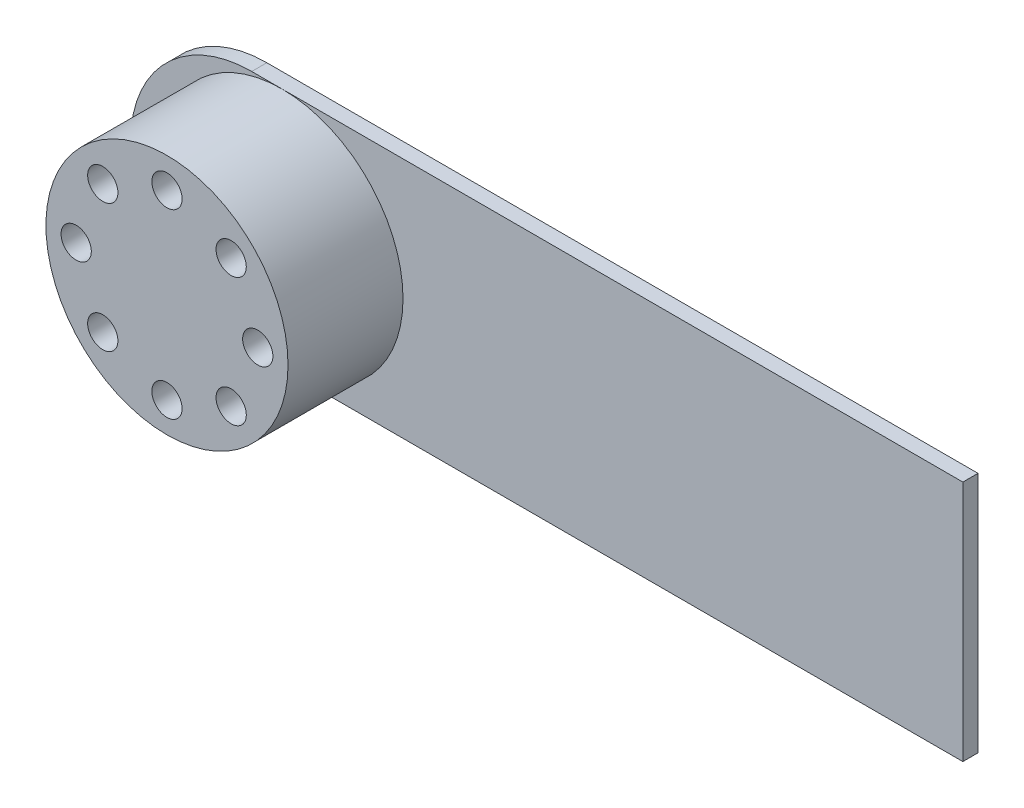
ISO-10303-21;
HEADER;
FILE_DESCRIPTION(('STEP AP214'),'2;1');
FILE_NAME('part.step','',(''),(''),'','','');
FILE_SCHEMA(('AUTOMOTIVE_DESIGN { 1 0 10303 214 1 1 1 1 }'));
ENDSEC;
DATA;
#1=APPLICATION_CONTEXT('core data for automotive mechanical design processes');
#2=APPLICATION_PROTOCOL_DEFINITION('international standard','automotive_design',2000,#1);
#3=PRODUCT_CONTEXT('',#1,'mechanical');
#4=PRODUCT('Part','Part','',(#3));
#5=PRODUCT_RELATED_PRODUCT_CATEGORY('part','',(#4));
#6=PRODUCT_DEFINITION_FORMATION('','',#4);
#7=PRODUCT_DEFINITION_CONTEXT('part definition',#1,'design');
#8=PRODUCT_DEFINITION('design','',#6,#7);
#9=PRODUCT_DEFINITION_SHAPE('','',#8);
#10=(LENGTH_UNIT() NAMED_UNIT(*) SI_UNIT(.MILLI.,.METRE.));
#11=(NAMED_UNIT(*) PLANE_ANGLE_UNIT() SI_UNIT($,.RADIAN.));
#12=(NAMED_UNIT(*) SI_UNIT($,.STERADIAN.) SOLID_ANGLE_UNIT());
#13=UNCERTAINTY_MEASURE_WITH_UNIT(LENGTH_MEASURE(1.E-05),#10,'distance_accuracy_value','');
#14=(GEOMETRIC_REPRESENTATION_CONTEXT(3) GLOBAL_UNCERTAINTY_ASSIGNED_CONTEXT((#13)) GLOBAL_UNIT_ASSIGNED_CONTEXT((#10,
#11,#12)) REPRESENTATION_CONTEXT('',''));
#15=CARTESIAN_POINT('',(0.,0.,0.));
#16=DIRECTION('',(0.,0.,1.));
#17=DIRECTION('',(1.,0.,0.));
#18=AXIS2_PLACEMENT_3D('',#15,#16,#17);
#19=CARTESIAN_POINT('',(-4.7,0.799999999999999,0.1));
#20=DIRECTION('',(0.,0.,-1.));
#21=DIRECTION('',(-1.,0.,0.));
#22=AXIS2_PLACEMENT_3D('',#19,#20,#21);
#23=PLANE('',#22);
#24=CARTESIAN_POINT('',(-4.5,0.8,0.1));
#25=DIRECTION('',(0.,0.,1.));
#26=DIRECTION('',(1.,0.,0.));
#27=AXIS2_PLACEMENT_3D('',#24,#25,#26);
#28=CIRCLE('',#27,0.8);
#29=CARTESIAN_POINT('',(-4.5,1.6,0.1));
#30=VERTEX_POINT('',#29);
#31=CARTESIAN_POINT('',(-4.5,0.,0.1));
#32=VERTEX_POINT('',#31);
#33=EDGE_CURVE('E43',#30,#32,#28,.T.);
#34=ORIENTED_EDGE('',*,*,#33,.F.);
#35=DIRECTION('',(-1.,0.,0.));
#36=VECTOR('',#35,1.);
#37=CARTESIAN_POINT('',(0.,1.6,0.1));
#38=LINE('',#37,#36);
#39=CARTESIAN_POINT('',(-4.7,1.6,0.1));
#40=VERTEX_POINT('',#39);
#41=EDGE_CURVE('E91',#30,#40,#38,.T.);
#42=ORIENTED_EDGE('',*,*,#41,.T.);
#43=CARTESIAN_POINT('',(-4.7,0.799999999999999,0.1));
#44=DIRECTION('',(0.,0.,-1.));
#45=DIRECTION('',(-1.,0.,0.));
#46=AXIS2_PLACEMENT_3D('',#43,#44,#45);
#47=CIRCLE('',#46,0.8);
#48=CARTESIAN_POINT('',(-4.7,0.,0.1));
#49=VERTEX_POINT('',#48);
#50=EDGE_CURVE('E90',#49,#40,#47,.T.);
#51=ORIENTED_EDGE('',*,*,#50,.F.);
#52=DIRECTION('',(-1.,0.,0.));
#53=VECTOR('',#52,1.);
#54=CARTESIAN_POINT('',(0.,0.,0.1));
#55=LINE('',#54,#53);
#56=EDGE_CURVE('E102',#32,#49,#55,.T.);
#57=ORIENTED_EDGE('',*,*,#56,.F.);
#58=EDGE_LOOP('',(#34,#42,#51,#57));
#59=FACE_BOUND('',#58,.T.);
#60=ADVANCED_FACE('F33',(#59),#23,.F.);
#61=EDGE_CURVE('E11',#32,#30,#28,.T.);
#62=ORIENTED_EDGE('',*,*,#61,.F.);
#63=CARTESIAN_POINT('',(0.,0.,0.1));
#64=VERTEX_POINT('',#63);
#65=EDGE_CURVE('E149',#64,#32,#55,.T.);
#66=ORIENTED_EDGE('',*,*,#65,.F.);
#67=DIRECTION('',(0.,1.,0.));
#68=VECTOR('',#67,1.);
#69=CARTESIAN_POINT('',(0.,0.,0.1));
#70=LINE('',#69,#68);
#71=CARTESIAN_POINT('',(0.,1.6,0.1));
#72=VERTEX_POINT('',#71);
#73=EDGE_CURVE('E88',#64,#72,#70,.T.);
#74=ORIENTED_EDGE('',*,*,#73,.T.);
#75=EDGE_CURVE('E83',#72,#30,#38,.T.);
#76=ORIENTED_EDGE('',*,*,#75,.T.);
#77=EDGE_LOOP('',(#62,#66,#74,#76));
#78=FACE_BOUND('',#77,.T.);
#79=ADVANCED_FACE('F87',(#78),#23,.F.);
#80=CARTESIAN_POINT('',(0.,0.,0.1));
#81=DIRECTION('',(-1.,0.,0.));
#82=DIRECTION('',(0.,0.,1.));
#83=AXIS2_PLACEMENT_3D('',#80,#81,#82);
#84=PLANE('',#83);
#85=DIRECTION('',(0.,1.,0.));
#86=VECTOR('',#85,1.);
#87=CARTESIAN_POINT('',(0.,0.,0.));
#88=LINE('',#87,#86);
#89=CARTESIAN_POINT('',(0.,0.,0.));
#90=VERTEX_POINT('',#89);
#91=CARTESIAN_POINT('',(0.,1.6,0.));
#92=VERTEX_POINT('',#91);
#93=EDGE_CURVE('E140',#90,#92,#88,.T.);
#94=ORIENTED_EDGE('',*,*,#93,.T.);
#95=DIRECTION('',(0.,0.,-1.));
#96=VECTOR('',#95,1.);
#97=CARTESIAN_POINT('',(0.,1.6,0.1));
#98=LINE('',#97,#96);
#99=EDGE_CURVE('E37',#72,#92,#98,.T.);
#100=ORIENTED_EDGE('',*,*,#99,.F.);
#101=ORIENTED_EDGE('',*,*,#73,.F.);
#102=DIRECTION('',(0.,0.,-1.));
#103=VECTOR('',#102,1.);
#104=CARTESIAN_POINT('',(0.,0.,0.1));
#105=LINE('',#104,#103);
#106=EDGE_CURVE('E57',#64,#90,#105,.T.);
#107=ORIENTED_EDGE('',*,*,#106,.T.);
#108=EDGE_LOOP('',(#94,#100,#101,#107));
#109=FACE_BOUND('',#108,.T.);
#110=ADVANCED_FACE('F35',(#109),#84,.F.);
#111=CARTESIAN_POINT('',(0.,1.6,0.1));
#112=DIRECTION('',(0.,-1.,0.));
#113=DIRECTION('',(1.,0.,0.));
#114=AXIS2_PLACEMENT_3D('',#111,#112,#113);
#115=PLANE('',#114);
#116=DIRECTION('',(-1.,0.,0.));
#117=VECTOR('',#116,1.);
#118=CARTESIAN_POINT('',(0.,1.6,0.));
#119=LINE('',#118,#117);
#120=CARTESIAN_POINT('',(-4.7,1.6,0.));
#121=VERTEX_POINT('',#120);
#122=EDGE_CURVE('E142',#92,#121,#119,.T.);
#123=ORIENTED_EDGE('',*,*,#122,.T.);
#124=DIRECTION('',(0.,0.,-1.));
#125=VECTOR('',#124,1.);
#126=CARTESIAN_POINT('',(-4.7,1.6,0.1));
#127=LINE('',#126,#125);
#128=EDGE_CURVE('E97',#40,#121,#127,.T.);
#129=ORIENTED_EDGE('',*,*,#128,.F.);
#130=ORIENTED_EDGE('',*,*,#41,.F.);
#131=ORIENTED_EDGE('',*,*,#75,.F.);
#132=ORIENTED_EDGE('',*,*,#99,.T.);
#133=EDGE_LOOP('',(#123,#129,#130,#131,#132));
#134=FACE_BOUND('',#133,.T.);
#135=ADVANCED_FACE('F96',(#134),#115,.F.);
#136=CARTESIAN_POINT('',(-4.7,0.799999999999999,0.1));
#137=DIRECTION('',(0.,0.,-1.));
#138=DIRECTION('',(-1.,0.,0.));
#139=AXIS2_PLACEMENT_3D('',#136,#137,#138);
#140=CYLINDRICAL_SURFACE('',#139,0.8);
#141=CARTESIAN_POINT('',(-4.7,0.799999999999999,0.));
#142=DIRECTION('',(0.,0.,-1.));
#143=DIRECTION('',(-1.,0.,0.));
#144=AXIS2_PLACEMENT_3D('',#141,#142,#143);
#145=CIRCLE('',#144,0.8);
#146=CARTESIAN_POINT('',(-4.7,0.,0.));
#147=VERTEX_POINT('',#146);
#148=EDGE_CURVE('E144',#147,#121,#145,.T.);
#149=ORIENTED_EDGE('',*,*,#148,.F.);
#150=DIRECTION('',(0.,0.,-1.));
#151=VECTOR('',#150,1.);
#152=CARTESIAN_POINT('',(-4.7,0.,0.1));
#153=LINE('',#152,#151);
#154=EDGE_CURVE('E157',#49,#147,#153,.T.);
#155=ORIENTED_EDGE('',*,*,#154,.F.);
#156=ORIENTED_EDGE('',*,*,#50,.T.);
#157=ORIENTED_EDGE('',*,*,#128,.T.);
#158=EDGE_LOOP('',(#149,#155,#156,#157));
#159=FACE_BOUND('',#158,.T.);
#160=ADVANCED_FACE('F131',(#159),#140,.T.);
#161=CARTESIAN_POINT('',(0.,0.,0.1));
#162=DIRECTION('',(0.,-1.,0.));
#163=DIRECTION('',(0.,0.,-1.));
#164=AXIS2_PLACEMENT_3D('',#161,#162,#163);
#165=PLANE('',#164);
#166=DIRECTION('',(-1.,0.,0.));
#167=VECTOR('',#166,1.);
#168=CARTESIAN_POINT('',(0.,0.,0.));
#169=LINE('',#168,#167);
#170=EDGE_CURVE('E154',#90,#147,#169,.T.);
#171=ORIENTED_EDGE('',*,*,#170,.F.);
#172=ORIENTED_EDGE('',*,*,#106,.F.);
#173=ORIENTED_EDGE('',*,*,#65,.T.);
#174=ORIENTED_EDGE('',*,*,#56,.T.);
#175=ORIENTED_EDGE('',*,*,#154,.T.);
#176=EDGE_LOOP('',(#171,#172,#173,#174,#175));
#177=FACE_BOUND('',#176,.T.);
#178=ADVANCED_FACE('F119',(#177),#165,.T.);
#179=CARTESIAN_POINT('',(-4.7,0.799999999999999,0.));
#180=DIRECTION('',(0.,0.,-1.));
#181=DIRECTION('',(-1.,0.,0.));
#182=AXIS2_PLACEMENT_3D('',#179,#180,#181);
#183=PLANE('',#182);
#184=ORIENTED_EDGE('',*,*,#93,.F.);
#185=ORIENTED_EDGE('',*,*,#170,.T.);
#186=ORIENTED_EDGE('',*,*,#148,.T.);
#187=ORIENTED_EDGE('',*,*,#122,.F.);
#188=EDGE_LOOP('',(#184,#185,#186,#187));
#189=FACE_BOUND('',#188,.T.);
#190=ADVANCED_FACE('F109',(#189),#183,.T.);
#191=CARTESIAN_POINT('',(-4.5,0.8,0.86));
#192=DIRECTION('',(0.,0.,-1.));
#193=DIRECTION('',(-1.,0.,0.));
#194=AXIS2_PLACEMENT_3D('',#191,#192,#193);
#195=CYLINDRICAL_SURFACE('',#194,0.8);
#196=CARTESIAN_POINT('',(-4.5,0.8,0.86));
#197=DIRECTION('',(0.,0.,1.));
#198=DIRECTION('',(1.,0.,0.));
#199=AXIS2_PLACEMENT_3D('',#196,#197,#198);
#200=CIRCLE('',#199,0.8);
#201=CARTESIAN_POINT('',(-3.7,0.8,0.86));
#202=VERTEX_POINT('',#201);
#203=EDGE_CURVE('E104',#202,#202,#200,.T.);
#204=ORIENTED_EDGE('',*,*,#203,.F.);
#205=EDGE_LOOP('',(#204));
#206=FACE_BOUND('',#205,.T.);
#207=ORIENTED_EDGE('',*,*,#33,.T.);
#208=ORIENTED_EDGE('',*,*,#61,.T.);
#209=EDGE_LOOP('',(#207,#208));
#210=FACE_BOUND('',#209,.T.);
#211=ADVANCED_FACE('F106',(#206,#210),#195,.T.);
#212=CARTESIAN_POINT('',(-4.5,0.8,0.86));
#213=DIRECTION('',(0.,0.,1.));
#214=DIRECTION('',(1.,0.,0.));
#215=AXIS2_PLACEMENT_3D('',#212,#213,#214);
#216=PLANE('',#215);
#217=CARTESIAN_POINT('',(-4.92426406871192,1.22426406871193,0.86));
#218=DIRECTION('',(0.,0.,1.));
#219=DIRECTION('',(1.,0.,0.));
#220=AXIS2_PLACEMENT_3D('',#217,#218,#219);
#221=CIRCLE('',#220,0.0999999999999994);
#222=CARTESIAN_POINT('',(-4.82426406871192,1.22426406871193,0.86));
#223=VERTEX_POINT('',#222);
#224=EDGE_CURVE('E206',#223,#223,#221,.T.);
#225=ORIENTED_EDGE('',*,*,#224,.F.);
#226=EDGE_LOOP('',(#225));
#227=FACE_BOUND('',#226,.T.);
#228=CARTESIAN_POINT('',(-5.1,0.800000000000006,0.86));
#229=DIRECTION('',(0.,0.,1.));
#230=DIRECTION('',(1.,0.,0.));
#231=AXIS2_PLACEMENT_3D('',#228,#229,#230);
#232=CIRCLE('',#231,0.1);
#233=CARTESIAN_POINT('',(-5.,0.800000000000006,0.86));
#234=VERTEX_POINT('',#233);
#235=EDGE_CURVE('E200',#234,#234,#232,.T.);
#236=ORIENTED_EDGE('',*,*,#235,.F.);
#237=EDGE_LOOP('',(#236));
#238=FACE_BOUND('',#237,.T.);
#239=CARTESIAN_POINT('',(-4.92426406871193,0.375735931288076,0.86));
#240=DIRECTION('',(0.,0.,1.));
#241=DIRECTION('',(1.,0.,0.));
#242=AXIS2_PLACEMENT_3D('',#239,#240,#241);
#243=CIRCLE('',#242,0.0999999999999994);
#244=CARTESIAN_POINT('',(-4.82426406871193,0.375735931288076,0.86));
#245=VERTEX_POINT('',#244);
#246=EDGE_CURVE('E194',#245,#245,#243,.T.);
#247=ORIENTED_EDGE('',*,*,#246,.F.);
#248=EDGE_LOOP('',(#247));
#249=FACE_BOUND('',#248,.T.);
#250=CARTESIAN_POINT('',(-4.5,0.2,0.86));
#251=DIRECTION('',(0.,0.,1.));
#252=DIRECTION('',(1.,0.,0.));
#253=AXIS2_PLACEMENT_3D('',#250,#251,#252);
#254=CIRCLE('',#253,0.1);
#255=CARTESIAN_POINT('',(-4.4,0.2,0.86));
#256=VERTEX_POINT('',#255);
#257=EDGE_CURVE('E188',#256,#256,#254,.T.);
#258=ORIENTED_EDGE('',*,*,#257,.F.);
#259=EDGE_LOOP('',(#258));
#260=FACE_BOUND('',#259,.T.);
#261=CARTESIAN_POINT('',(-4.07573593128807,0.375735931288069,0.86));
#262=DIRECTION('',(0.,0.,1.));
#263=DIRECTION('',(1.,0.,0.));
#264=AXIS2_PLACEMENT_3D('',#261,#262,#263);
#265=CIRCLE('',#264,0.0999999999999994);
#266=CARTESIAN_POINT('',(-3.97573593128808,0.375735931288069,0.86));
#267=VERTEX_POINT('',#266);
#268=EDGE_CURVE('E182',#267,#267,#265,.T.);
#269=ORIENTED_EDGE('',*,*,#268,.F.);
#270=EDGE_LOOP('',(#269));
#271=FACE_BOUND('',#270,.T.);
#272=CARTESIAN_POINT('',(-3.9,0.799999999999997,0.86));
#273=DIRECTION('',(0.,0.,1.));
#274=DIRECTION('',(1.,0.,0.));
#275=AXIS2_PLACEMENT_3D('',#272,#273,#274);
#276=CIRCLE('',#275,0.0999999999999998);
#277=CARTESIAN_POINT('',(-3.8,0.799999999999997,0.86));
#278=VERTEX_POINT('',#277);
#279=EDGE_CURVE('E176',#278,#278,#276,.T.);
#280=ORIENTED_EDGE('',*,*,#279,.F.);
#281=EDGE_LOOP('',(#280));
#282=FACE_BOUND('',#281,.T.);
#283=CARTESIAN_POINT('',(-4.07573593128807,1.22426406871193,0.86));
#284=DIRECTION('',(0.,0.,1.));
#285=DIRECTION('',(1.,0.,0.));
#286=AXIS2_PLACEMENT_3D('',#283,#284,#285);
#287=CIRCLE('',#286,0.1);
#288=CARTESIAN_POINT('',(-3.97573593128807,1.22426406871193,0.86));
#289=VERTEX_POINT('',#288);
#290=EDGE_CURVE('E170',#289,#289,#287,.T.);
#291=ORIENTED_EDGE('',*,*,#290,.F.);
#292=EDGE_LOOP('',(#291));
#293=FACE_BOUND('',#292,.T.);
#294=CARTESIAN_POINT('',(-4.5,1.4,0.86));
#295=DIRECTION('',(0.,0.,1.));
#296=DIRECTION('',(1.,0.,0.));
#297=AXIS2_PLACEMENT_3D('',#294,#295,#296);
#298=CIRCLE('',#297,0.1);
#299=CARTESIAN_POINT('',(-4.4,1.4,0.86));
#300=VERTEX_POINT('',#299);
#301=EDGE_CURVE('E164',#300,#300,#298,.T.);
#302=ORIENTED_EDGE('',*,*,#301,.F.);
#303=EDGE_LOOP('',(#302));
#304=FACE_BOUND('',#303,.T.);
#305=ORIENTED_EDGE('',*,*,#203,.T.);
#306=EDGE_LOOP('',(#305));
#307=FACE_BOUND('',#306,.T.);
#308=ADVANCED_FACE('F108',(#227,#238,#249,#260,#271,#282,#293,#304,#307),#216,.T.);
#309=CARTESIAN_POINT('',(-4.5,1.4,0.46));
#310=DIRECTION('',(0.,0.,-1.));
#311=DIRECTION('',(-1.,0.,0.));
#312=AXIS2_PLACEMENT_3D('',#309,#310,#311);
#313=PLANE('',#312);
#314=CARTESIAN_POINT('',(-4.5,1.4,0.46));
#315=DIRECTION('',(0.,0.,1.));
#316=DIRECTION('',(1.,0.,0.));
#317=AXIS2_PLACEMENT_3D('',#314,#315,#316);
#318=CIRCLE('',#317,0.1);
#319=CARTESIAN_POINT('',(-4.4,1.4,0.46));
#320=VERTEX_POINT('',#319);
#321=EDGE_CURVE('E105',#320,#320,#318,.T.);
#322=ORIENTED_EDGE('',*,*,#321,.T.);
#323=EDGE_LOOP('',(#322));
#324=FACE_BOUND('',#323,.T.);
#325=ADVANCED_FACE('F116',(#324),#313,.F.);
#326=CARTESIAN_POINT('',(-4.5,1.4,0.86));
#327=DIRECTION('',(0.,0.,1.));
#328=DIRECTION('',(1.,0.,0.));
#329=AXIS2_PLACEMENT_3D('',#326,#327,#328);
#330=CYLINDRICAL_SURFACE('',#329,0.1);
#331=ORIENTED_EDGE('',*,*,#321,.F.);
#332=EDGE_LOOP('',(#331));
#333=FACE_BOUND('',#332,.T.);
#334=ORIENTED_EDGE('',*,*,#301,.T.);
#335=EDGE_LOOP('',(#334));
#336=FACE_BOUND('',#335,.T.);
#337=ADVANCED_FACE('F227',(#333,#336),#330,.F.);
#338=CARTESIAN_POINT('',(-4.07573593128807,1.22426406871193,0.46));
#339=DIRECTION('',(0.,0.,-1.));
#340=DIRECTION('',(-1.,0.,0.));
#341=AXIS2_PLACEMENT_3D('',#338,#339,#340);
#342=PLANE('',#341);
#343=CARTESIAN_POINT('',(-4.07573593128807,1.22426406871193,0.46));
#344=DIRECTION('',(0.,0.,1.));
#345=DIRECTION('',(1.,0.,0.));
#346=AXIS2_PLACEMENT_3D('',#343,#344,#345);
#347=CIRCLE('',#346,0.1);
#348=CARTESIAN_POINT('',(-3.97573593128807,1.22426406871193,0.46));
#349=VERTEX_POINT('',#348);
#350=EDGE_CURVE('E167',#349,#349,#347,.T.);
#351=ORIENTED_EDGE('',*,*,#350,.T.);
#352=EDGE_LOOP('',(#351));
#353=FACE_BOUND('',#352,.T.);
#354=ADVANCED_FACE('F229',(#353),#342,.F.);
#355=CARTESIAN_POINT('',(-4.07573593128807,1.22426406871193,0.86));
#356=DIRECTION('',(0.,0.,1.));
#357=DIRECTION('',(1.,0.,0.));
#358=AXIS2_PLACEMENT_3D('',#355,#356,#357);
#359=CYLINDRICAL_SURFACE('',#358,0.1);
#360=ORIENTED_EDGE('',*,*,#350,.F.);
#361=EDGE_LOOP('',(#360));
#362=FACE_BOUND('',#361,.T.);
#363=ORIENTED_EDGE('',*,*,#290,.T.);
#364=EDGE_LOOP('',(#363));
#365=FACE_BOUND('',#364,.T.);
#366=ADVANCED_FACE('F236',(#362,#365),#359,.F.);
#367=CARTESIAN_POINT('',(-3.9,0.799999999999997,0.46));
#368=DIRECTION('',(0.,0.,-1.));
#369=DIRECTION('',(-1.,0.,0.));
#370=AXIS2_PLACEMENT_3D('',#367,#368,#369);
#371=PLANE('',#370);
#372=CARTESIAN_POINT('',(-3.9,0.799999999999997,0.46));
#373=DIRECTION('',(0.,0.,1.));
#374=DIRECTION('',(1.,0.,0.));
#375=AXIS2_PLACEMENT_3D('',#372,#373,#374);
#376=CIRCLE('',#375,0.0999999999999998);
#377=CARTESIAN_POINT('',(-3.8,0.799999999999997,0.46));
#378=VERTEX_POINT('',#377);
#379=EDGE_CURVE('E173',#378,#378,#376,.T.);
#380=ORIENTED_EDGE('',*,*,#379,.T.);
#381=EDGE_LOOP('',(#380));
#382=FACE_BOUND('',#381,.T.);
#383=ADVANCED_FACE('F245',(#382),#371,.F.);
#384=CARTESIAN_POINT('',(-3.9,0.799999999999997,0.86));
#385=DIRECTION('',(0.,0.,1.));
#386=DIRECTION('',(1.,0.,0.));
#387=AXIS2_PLACEMENT_3D('',#384,#385,#386);
#388=CYLINDRICAL_SURFACE('',#387,0.0999999999999998);
#389=ORIENTED_EDGE('',*,*,#379,.F.);
#390=EDGE_LOOP('',(#389));
#391=FACE_BOUND('',#390,.T.);
#392=ORIENTED_EDGE('',*,*,#279,.T.);
#393=EDGE_LOOP('',(#392));
#394=FACE_BOUND('',#393,.T.);
#395=ADVANCED_FACE('F249',(#391,#394),#388,.F.);
#396=CARTESIAN_POINT('',(-4.07573593128807,0.375735931288069,0.46));
#397=DIRECTION('',(0.,0.,-1.));
#398=DIRECTION('',(-1.,0.,0.));
#399=AXIS2_PLACEMENT_3D('',#396,#397,#398);
#400=PLANE('',#399);
#401=CARTESIAN_POINT('',(-4.07573593128807,0.375735931288069,0.46));
#402=DIRECTION('',(0.,0.,1.));
#403=DIRECTION('',(1.,0.,0.));
#404=AXIS2_PLACEMENT_3D('',#401,#402,#403);
#405=CIRCLE('',#404,0.0999999999999994);
#406=CARTESIAN_POINT('',(-3.97573593128808,0.375735931288069,0.46));
#407=VERTEX_POINT('',#406);
#408=EDGE_CURVE('E179',#407,#407,#405,.T.);
#409=ORIENTED_EDGE('',*,*,#408,.T.);
#410=EDGE_LOOP('',(#409));
#411=FACE_BOUND('',#410,.T.);
#412=ADVANCED_FACE('F253',(#411),#400,.F.);
#413=CARTESIAN_POINT('',(-4.07573593128807,0.375735931288069,0.86));
#414=DIRECTION('',(0.,0.,1.));
#415=DIRECTION('',(1.,0.,0.));
#416=AXIS2_PLACEMENT_3D('',#413,#414,#415);
#417=CYLINDRICAL_SURFACE('',#416,0.0999999999999994);
#418=ORIENTED_EDGE('',*,*,#408,.F.);
#419=EDGE_LOOP('',(#418));
#420=FACE_BOUND('',#419,.T.);
#421=ORIENTED_EDGE('',*,*,#268,.T.);
#422=EDGE_LOOP('',(#421));
#423=FACE_BOUND('',#422,.T.);
#424=ADVANCED_FACE('F257',(#420,#423),#417,.F.);
#425=CARTESIAN_POINT('',(-4.5,0.2,0.46));
#426=DIRECTION('',(0.,0.,-1.));
#427=DIRECTION('',(-1.,0.,0.));
#428=AXIS2_PLACEMENT_3D('',#425,#426,#427);
#429=PLANE('',#428);
#430=CARTESIAN_POINT('',(-4.5,0.2,0.46));
#431=DIRECTION('',(0.,0.,1.));
#432=DIRECTION('',(1.,0.,0.));
#433=AXIS2_PLACEMENT_3D('',#430,#431,#432);
#434=CIRCLE('',#433,0.1);
#435=CARTESIAN_POINT('',(-4.4,0.2,0.46));
#436=VERTEX_POINT('',#435);
#437=EDGE_CURVE('E185',#436,#436,#434,.T.);
#438=ORIENTED_EDGE('',*,*,#437,.T.);
#439=EDGE_LOOP('',(#438));
#440=FACE_BOUND('',#439,.T.);
#441=ADVANCED_FACE('F261',(#440),#429,.F.);
#442=CARTESIAN_POINT('',(-4.5,0.2,0.86));
#443=DIRECTION('',(0.,0.,1.));
#444=DIRECTION('',(1.,0.,0.));
#445=AXIS2_PLACEMENT_3D('',#442,#443,#444);
#446=CYLINDRICAL_SURFACE('',#445,0.1);
#447=ORIENTED_EDGE('',*,*,#437,.F.);
#448=EDGE_LOOP('',(#447));
#449=FACE_BOUND('',#448,.T.);
#450=ORIENTED_EDGE('',*,*,#257,.T.);
#451=EDGE_LOOP('',(#450));
#452=FACE_BOUND('',#451,.T.);
#453=ADVANCED_FACE('F265',(#449,#452),#446,.F.);
#454=CARTESIAN_POINT('',(-4.92426406871193,0.375735931288076,0.46));
#455=DIRECTION('',(0.,0.,-1.));
#456=DIRECTION('',(-1.,0.,0.));
#457=AXIS2_PLACEMENT_3D('',#454,#455,#456);
#458=PLANE('',#457);
#459=CARTESIAN_POINT('',(-4.92426406871193,0.375735931288076,0.46));
#460=DIRECTION('',(0.,0.,1.));
#461=DIRECTION('',(1.,0.,0.));
#462=AXIS2_PLACEMENT_3D('',#459,#460,#461);
#463=CIRCLE('',#462,0.0999999999999994);
#464=CARTESIAN_POINT('',(-4.82426406871193,0.375735931288076,0.46));
#465=VERTEX_POINT('',#464);
#466=EDGE_CURVE('E191',#465,#465,#463,.T.);
#467=ORIENTED_EDGE('',*,*,#466,.T.);
#468=EDGE_LOOP('',(#467));
#469=FACE_BOUND('',#468,.T.);
#470=ADVANCED_FACE('F269',(#469),#458,.F.);
#471=CARTESIAN_POINT('',(-4.92426406871193,0.375735931288076,0.86));
#472=DIRECTION('',(0.,0.,1.));
#473=DIRECTION('',(1.,0.,0.));
#474=AXIS2_PLACEMENT_3D('',#471,#472,#473);
#475=CYLINDRICAL_SURFACE('',#474,0.0999999999999994);
#476=ORIENTED_EDGE('',*,*,#466,.F.);
#477=EDGE_LOOP('',(#476));
#478=FACE_BOUND('',#477,.T.);
#479=ORIENTED_EDGE('',*,*,#246,.T.);
#480=EDGE_LOOP('',(#479));
#481=FACE_BOUND('',#480,.T.);
#482=ADVANCED_FACE('F273',(#478,#481),#475,.F.);
#483=CARTESIAN_POINT('',(-5.1,0.800000000000006,0.46));
#484=DIRECTION('',(0.,0.,-1.));
#485=DIRECTION('',(-1.,0.,0.));
#486=AXIS2_PLACEMENT_3D('',#483,#484,#485);
#487=PLANE('',#486);
#488=CARTESIAN_POINT('',(-5.1,0.800000000000006,0.46));
#489=DIRECTION('',(0.,0.,1.));
#490=DIRECTION('',(1.,0.,0.));
#491=AXIS2_PLACEMENT_3D('',#488,#489,#490);
#492=CIRCLE('',#491,0.1);
#493=CARTESIAN_POINT('',(-5.,0.800000000000006,0.46));
#494=VERTEX_POINT('',#493);
#495=EDGE_CURVE('E197',#494,#494,#492,.T.);
#496=ORIENTED_EDGE('',*,*,#495,.T.);
#497=EDGE_LOOP('',(#496));
#498=FACE_BOUND('',#497,.T.);
#499=ADVANCED_FACE('F277',(#498),#487,.F.);
#500=CARTESIAN_POINT('',(-5.1,0.800000000000006,0.86));
#501=DIRECTION('',(0.,0.,1.));
#502=DIRECTION('',(1.,0.,0.));
#503=AXIS2_PLACEMENT_3D('',#500,#501,#502);
#504=CYLINDRICAL_SURFACE('',#503,0.1);
#505=ORIENTED_EDGE('',*,*,#495,.F.);
#506=EDGE_LOOP('',(#505));
#507=FACE_BOUND('',#506,.T.);
#508=ORIENTED_EDGE('',*,*,#235,.T.);
#509=EDGE_LOOP('',(#508));
#510=FACE_BOUND('',#509,.T.);
#511=ADVANCED_FACE('F281',(#507,#510),#504,.F.);
#512=CARTESIAN_POINT('',(-4.92426406871192,1.22426406871193,0.46));
#513=DIRECTION('',(0.,0.,-1.));
#514=DIRECTION('',(-1.,0.,0.));
#515=AXIS2_PLACEMENT_3D('',#512,#513,#514);
#516=PLANE('',#515);
#517=CARTESIAN_POINT('',(-4.92426406871192,1.22426406871193,0.46));
#518=DIRECTION('',(0.,0.,1.));
#519=DIRECTION('',(1.,0.,0.));
#520=AXIS2_PLACEMENT_3D('',#517,#518,#519);
#521=CIRCLE('',#520,0.0999999999999994);
#522=CARTESIAN_POINT('',(-4.82426406871192,1.22426406871193,0.46));
#523=VERTEX_POINT('',#522);
#524=EDGE_CURVE('E203',#523,#523,#521,.T.);
#525=ORIENTED_EDGE('',*,*,#524,.T.);
#526=EDGE_LOOP('',(#525));
#527=FACE_BOUND('',#526,.T.);
#528=ADVANCED_FACE('F285',(#527),#516,.F.);
#529=CARTESIAN_POINT('',(-4.92426406871192,1.22426406871193,0.86));
#530=DIRECTION('',(0.,0.,1.));
#531=DIRECTION('',(1.,0.,0.));
#532=AXIS2_PLACEMENT_3D('',#529,#530,#531);
#533=CYLINDRICAL_SURFACE('',#532,0.0999999999999994);
#534=ORIENTED_EDGE('',*,*,#524,.F.);
#535=EDGE_LOOP('',(#534));
#536=FACE_BOUND('',#535,.T.);
#537=ORIENTED_EDGE('',*,*,#224,.T.);
#538=EDGE_LOOP('',(#537));
#539=FACE_BOUND('',#538,.T.);
#540=ADVANCED_FACE('F210',(#536,#539),#533,.F.);
#541=CLOSED_SHELL('',(#60,#79,#110,#135,#160,#178,#190,#211,#308,#325,#337,#354,#366,#383,#395,
#412,#424,#441,#453,#470,#482,#499,#511,#528,#540));
#542=MANIFOLD_SOLID_BREP('B2',#541);
#543=ADVANCED_BREP_SHAPE_REPRESENTATION('',(#18,#542),#14);
#544=SHAPE_DEFINITION_REPRESENTATION(#9,#543);
ENDSEC;
END-ISO-10303-21;
